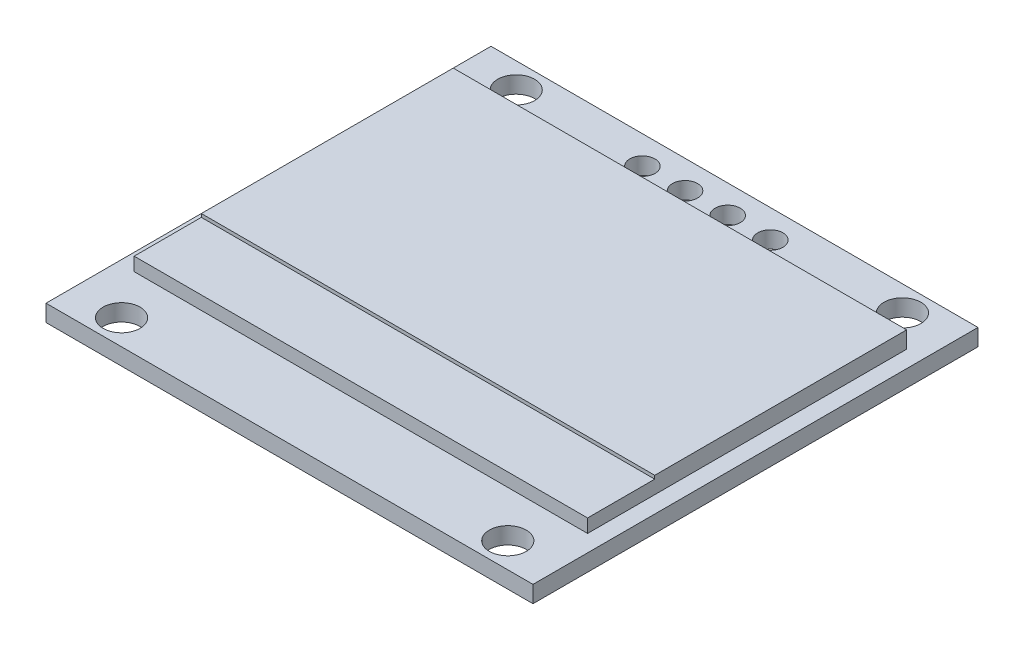
ISO-10303-21;
HEADER;
FILE_DESCRIPTION(('STEP AP214'),'2;1');
FILE_NAME('part.step','',(''),(''),'','','');
FILE_SCHEMA(('AUTOMOTIVE_DESIGN { 1 0 10303 214 1 1 1 1 }'));
ENDSEC;
DATA;
#1=APPLICATION_CONTEXT('core data for automotive mechanical design processes');
#2=APPLICATION_PROTOCOL_DEFINITION('international standard','automotive_design',2000,#1);
#3=PRODUCT_CONTEXT('',#1,'mechanical');
#4=PRODUCT('Part','Part','',(#3));
#5=PRODUCT_RELATED_PRODUCT_CATEGORY('part','',(#4));
#6=PRODUCT_DEFINITION_FORMATION('','',#4);
#7=PRODUCT_DEFINITION_CONTEXT('part definition',#1,'design');
#8=PRODUCT_DEFINITION('design','',#6,#7);
#9=PRODUCT_DEFINITION_SHAPE('','',#8);
#10=(LENGTH_UNIT() NAMED_UNIT(*) SI_UNIT(.MILLI.,.METRE.));
#11=(NAMED_UNIT(*) PLANE_ANGLE_UNIT() SI_UNIT($,.RADIAN.));
#12=(NAMED_UNIT(*) SI_UNIT($,.STERADIAN.) SOLID_ANGLE_UNIT());
#13=UNCERTAINTY_MEASURE_WITH_UNIT(LENGTH_MEASURE(1.E-05),#10,'distance_accuracy_value','');
#14=(GEOMETRIC_REPRESENTATION_CONTEXT(3) GLOBAL_UNCERTAINTY_ASSIGNED_CONTEXT((#13)) GLOBAL_UNIT_ASSIGNED_CONTEXT((#10,
#11,#12)) REPRESENTATION_CONTEXT('',''));
#15=CARTESIAN_POINT('',(0.,0.,0.));
#16=DIRECTION('',(0.,0.,1.));
#17=DIRECTION('',(1.,0.,0.));
#18=AXIS2_PLACEMENT_3D('',#15,#16,#17);
#19=CARTESIAN_POINT('',(0.,1.,0.));
#20=DIRECTION('',(0.,1.,0.));
#21=DIRECTION('',(0.,0.,1.));
#22=AXIS2_PLACEMENT_3D('',#19,#20,#21);
#23=PLANE('',#22);
#24=CARTESIAN_POINT('',(-3.81,1.,-12.0736482504211));
#25=DIRECTION('',(0.,1.,0.));
#26=DIRECTION('',(0.,0.,1.));
#27=AXIS2_PLACEMENT_3D('',#24,#25,#26);
#28=CIRCLE('',#27,0.75);
#29=CARTESIAN_POINT('',(-3.81,1.,-11.3236482504211));
#30=VERTEX_POINT('',#29);
#31=EDGE_CURVE('E235',#30,#30,#28,.T.);
#32=ORIENTED_EDGE('',*,*,#31,.F.);
#33=EDGE_LOOP('',(#32));
#34=FACE_BOUND('',#33,.T.);
#35=CARTESIAN_POINT('',(3.81,1.,-12.0736482504211));
#36=DIRECTION('',(0.,1.,0.));
#37=DIRECTION('',(0.,0.,1.));
#38=AXIS2_PLACEMENT_3D('',#35,#36,#37);
#39=CIRCLE('',#38,0.750000000000001);
#40=CARTESIAN_POINT('',(3.81,1.,-11.3236482504211));
#41=VERTEX_POINT('',#40);
#42=EDGE_CURVE('E238',#41,#41,#39,.T.);
#43=ORIENTED_EDGE('',*,*,#42,.F.);
#44=EDGE_LOOP('',(#43));
#45=FACE_BOUND('',#44,.T.);
#46=CARTESIAN_POINT('',(1.27,1.,-12.0736482504211));
#47=DIRECTION('',(0.,1.,0.));
#48=DIRECTION('',(0.,0.,1.));
#49=AXIS2_PLACEMENT_3D('',#46,#47,#48);
#50=CIRCLE('',#49,0.75);
#51=CARTESIAN_POINT('',(1.27,1.,-11.3236482504211));
#52=VERTEX_POINT('',#51);
#53=EDGE_CURVE('E234',#52,#52,#50,.T.);
#54=ORIENTED_EDGE('',*,*,#53,.F.);
#55=EDGE_LOOP('',(#54));
#56=FACE_BOUND('',#55,.T.);
#57=CARTESIAN_POINT('',(-1.27,1.,-12.0736482504211));
#58=DIRECTION('',(0.,1.,0.));
#59=DIRECTION('',(0.,0.,1.));
#60=AXIS2_PLACEMENT_3D('',#57,#58,#59);
#61=CIRCLE('',#60,0.75);
#62=CARTESIAN_POINT('',(-1.27,1.,-11.3236482504211));
#63=VERTEX_POINT('',#62);
#64=EDGE_CURVE('E221',#63,#63,#61,.T.);
#65=ORIENTED_EDGE('',*,*,#64,.F.);
#66=EDGE_LOOP('',(#65));
#67=FACE_BOUND('',#66,.T.);
#68=CARTESIAN_POINT('',(11.5,1.,-12.25));
#69=DIRECTION('',(0.,1.,0.));
#70=DIRECTION('',(0.,0.,1.));
#71=AXIS2_PLACEMENT_3D('',#68,#69,#70);
#72=CIRCLE('',#71,1.1);
#73=CARTESIAN_POINT('',(11.5,1.,-11.15));
#74=VERTEX_POINT('',#73);
#75=EDGE_CURVE('E174',#74,#74,#72,.T.);
#76=ORIENTED_EDGE('',*,*,#75,.F.);
#77=EDGE_LOOP('',(#76));
#78=FACE_BOUND('',#77,.T.);
#79=CARTESIAN_POINT('',(-11.5,1.,11.25));
#80=DIRECTION('',(0.,1.,0.));
#81=DIRECTION('',(0.,0.,1.));
#82=AXIS2_PLACEMENT_3D('',#79,#80,#81);
#83=CIRCLE('',#82,1.1);
#84=CARTESIAN_POINT('',(-11.5,1.,12.35));
#85=VERTEX_POINT('',#84);
#86=EDGE_CURVE('E181',#85,#85,#83,.T.);
#87=ORIENTED_EDGE('',*,*,#86,.F.);
#88=EDGE_LOOP('',(#87));
#89=FACE_BOUND('',#88,.T.);
#90=CARTESIAN_POINT('',(11.5,1.,11.2499999999999));
#91=DIRECTION('',(0.,1.,0.));
#92=DIRECTION('',(0.,0.,1.));
#93=AXIS2_PLACEMENT_3D('',#90,#91,#92);
#94=CIRCLE('',#93,1.1);
#95=CARTESIAN_POINT('',(11.5,1.,12.3499999999999));
#96=VERTEX_POINT('',#95);
#97=EDGE_CURVE('E168',#96,#96,#94,.T.);
#98=ORIENTED_EDGE('',*,*,#97,.F.);
#99=EDGE_LOOP('',(#98));
#100=FACE_BOUND('',#99,.T.);
#101=CARTESIAN_POINT('',(-11.5,1.,-12.25));
#102=DIRECTION('',(0.,1.,0.));
#103=DIRECTION('',(0.,0.,1.));
#104=AXIS2_PLACEMENT_3D('',#101,#102,#103);
#105=CIRCLE('',#104,1.1);
#106=CARTESIAN_POINT('',(-11.5,1.,-11.15));
#107=VERTEX_POINT('',#106);
#108=EDGE_CURVE('E177',#107,#107,#105,.T.);
#109=ORIENTED_EDGE('',*,*,#108,.F.);
#110=EDGE_LOOP('',(#109));
#111=FACE_BOUND('',#110,.T.);
#112=DIRECTION('',(0.,0.,1.));
#113=VECTOR('',#112,1.);
#114=CARTESIAN_POINT('',(-14.5,1.,-13.75));
#115=LINE('',#114,#113);
#116=CARTESIAN_POINT('',(-14.5,1.,-13.75));
#117=VERTEX_POINT('',#116);
#118=CARTESIAN_POINT('',(-14.5,1.,12.75));
#119=VERTEX_POINT('',#118);
#120=EDGE_CURVE('E192',#117,#119,#115,.T.);
#121=ORIENTED_EDGE('',*,*,#120,.T.);
#122=DIRECTION('',(1.,0.,0.));
#123=VECTOR('',#122,1.);
#124=CARTESIAN_POINT('',(-14.5,1.,12.75));
#125=LINE('',#124,#123);
#126=CARTESIAN_POINT('',(14.5,1.,12.75));
#127=VERTEX_POINT('',#126);
#128=EDGE_CURVE('E195',#119,#127,#125,.T.);
#129=ORIENTED_EDGE('',*,*,#128,.T.);
#130=DIRECTION('',(0.,0.,-1.));
#131=VECTOR('',#130,1.);
#132=CARTESIAN_POINT('',(14.5,1.,-13.75));
#133=LINE('',#132,#131);
#134=CARTESIAN_POINT('',(14.5,1.,-13.75));
#135=VERTEX_POINT('',#134);
#136=EDGE_CURVE('E198',#127,#135,#133,.T.);
#137=ORIENTED_EDGE('',*,*,#136,.T.);
#138=DIRECTION('',(-1.,0.,0.));
#139=VECTOR('',#138,1.);
#140=CARTESIAN_POINT('',(-14.5,1.,-13.75));
#141=LINE('',#140,#139);
#142=EDGE_CURVE('E200',#135,#117,#141,.T.);
#143=ORIENTED_EDGE('',*,*,#142,.T.);
#144=EDGE_LOOP('',(#121,#129,#137,#143));
#145=FACE_BOUND('',#144,.T.);
#146=DIRECTION('',(1.,0.,0.));
#147=VECTOR('',#146,1.);
#148=CARTESIAN_POINT('',(-13.5,1.,8.5));
#149=LINE('',#148,#147);
#150=CARTESIAN_POINT('',(-13.5,1.,8.5));
#151=VERTEX_POINT('',#150);
#152=CARTESIAN_POINT('',(13.5,1.,8.5));
#153=VERTEX_POINT('',#152);
#154=EDGE_CURVE('E126',#151,#153,#149,.T.);
#155=ORIENTED_EDGE('',*,*,#154,.F.);
#156=DIRECTION('',(0.,0.,1.));
#157=VECTOR('',#156,1.);
#158=CARTESIAN_POINT('',(-13.5,1.,-10.5));
#159=LINE('',#158,#157);
#160=CARTESIAN_POINT('',(-13.5,1.,-10.5));
#161=VERTEX_POINT('',#160);
#162=EDGE_CURVE('E139',#161,#151,#159,.T.);
#163=ORIENTED_EDGE('',*,*,#162,.F.);
#164=DIRECTION('',(-1.,0.,0.));
#165=VECTOR('',#164,1.);
#166=CARTESIAN_POINT('',(-13.5,1.,-10.5));
#167=LINE('',#166,#165);
#168=CARTESIAN_POINT('',(13.5,1.,-10.5));
#169=VERTEX_POINT('',#168);
#170=EDGE_CURVE('E149',#169,#161,#167,.T.);
#171=ORIENTED_EDGE('',*,*,#170,.F.);
#172=DIRECTION('',(0.,0.,-1.));
#173=VECTOR('',#172,1.);
#174=CARTESIAN_POINT('',(13.5,1.,-10.5));
#175=LINE('',#174,#173);
#176=EDGE_CURVE('E157',#153,#169,#175,.T.);
#177=ORIENTED_EDGE('',*,*,#176,.F.);
#178=EDGE_LOOP('',(#155,#163,#171,#177));
#179=FACE_BOUND('',#178,.T.);
#180=ADVANCED_FACE('F37',(#34,#45,#56,#67,#78,#89,#100,#111,#145,#179),#23,.T.);
#181=CARTESIAN_POINT('',(-14.5,1.,-13.75));
#182=DIRECTION('',(1.,0.,0.));
#183=DIRECTION('',(0.,0.,-1.));
#184=AXIS2_PLACEMENT_3D('',#181,#182,#183);
#185=PLANE('',#184);
#186=DIRECTION('',(0.,0.,1.));
#187=VECTOR('',#186,1.);
#188=CARTESIAN_POINT('',(-14.5,0.,-13.75));
#189=LINE('',#188,#187);
#190=CARTESIAN_POINT('',(-14.5,0.,-13.75));
#191=VERTEX_POINT('',#190);
#192=CARTESIAN_POINT('',(-14.5,0.,12.75));
#193=VERTEX_POINT('',#192);
#194=EDGE_CURVE('E189',#191,#193,#189,.T.);
#195=ORIENTED_EDGE('',*,*,#194,.T.);
#196=DIRECTION('',(0.,-1.,0.));
#197=VECTOR('',#196,1.);
#198=CARTESIAN_POINT('',(-14.5,1.,12.75));
#199=LINE('',#198,#197);
#200=EDGE_CURVE('E11',#119,#193,#199,.T.);
#201=ORIENTED_EDGE('',*,*,#200,.F.);
#202=ORIENTED_EDGE('',*,*,#120,.F.);
#203=DIRECTION('',(0.,-1.,0.));
#204=VECTOR('',#203,1.);
#205=CARTESIAN_POINT('',(-14.5,1.,-13.75));
#206=LINE('',#205,#204);
#207=EDGE_CURVE('E202',#117,#191,#206,.T.);
#208=ORIENTED_EDGE('',*,*,#207,.T.);
#209=EDGE_LOOP('',(#195,#201,#202,#208));
#210=FACE_BOUND('',#209,.T.);
#211=ADVANCED_FACE('F39',(#210),#185,.F.);
#212=CARTESIAN_POINT('',(-14.5,1.,12.75));
#213=DIRECTION('',(0.,0.,-1.));
#214=DIRECTION('',(-1.,0.,0.));
#215=AXIS2_PLACEMENT_3D('',#212,#213,#214);
#216=PLANE('',#215);
#217=DIRECTION('',(1.,0.,0.));
#218=VECTOR('',#217,1.);
#219=CARTESIAN_POINT('',(-14.5,0.,12.75));
#220=LINE('',#219,#218);
#221=CARTESIAN_POINT('',(14.5,0.,12.75));
#222=VERTEX_POINT('',#221);
#223=EDGE_CURVE('E205',#193,#222,#220,.T.);
#224=ORIENTED_EDGE('',*,*,#223,.T.);
#225=DIRECTION('',(0.,-1.,0.));
#226=VECTOR('',#225,1.);
#227=CARTESIAN_POINT('',(14.5,1.,12.75));
#228=LINE('',#227,#226);
#229=EDGE_CURVE('E46',#127,#222,#228,.T.);
#230=ORIENTED_EDGE('',*,*,#229,.F.);
#231=ORIENTED_EDGE('',*,*,#128,.F.);
#232=ORIENTED_EDGE('',*,*,#200,.T.);
#233=EDGE_LOOP('',(#224,#230,#231,#232));
#234=FACE_BOUND('',#233,.T.);
#235=ADVANCED_FACE('F315',(#234),#216,.F.);
#236=CARTESIAN_POINT('',(14.5,1.,-13.75));
#237=DIRECTION('',(-1.,0.,0.));
#238=DIRECTION('',(0.,0.,1.));
#239=AXIS2_PLACEMENT_3D('',#236,#237,#238);
#240=PLANE('',#239);
#241=DIRECTION('',(0.,0.,-1.));
#242=VECTOR('',#241,1.);
#243=CARTESIAN_POINT('',(14.5,0.,-13.75));
#244=LINE('',#243,#242);
#245=CARTESIAN_POINT('',(14.5,0.,-13.75));
#246=VERTEX_POINT('',#245);
#247=EDGE_CURVE('E207',#222,#246,#244,.T.);
#248=ORIENTED_EDGE('',*,*,#247,.T.);
#249=DIRECTION('',(0.,-1.,0.));
#250=VECTOR('',#249,1.);
#251=CARTESIAN_POINT('',(14.5,1.,-13.75));
#252=LINE('',#251,#250);
#253=EDGE_CURVE('E212',#135,#246,#252,.T.);
#254=ORIENTED_EDGE('',*,*,#253,.F.);
#255=ORIENTED_EDGE('',*,*,#136,.F.);
#256=ORIENTED_EDGE('',*,*,#229,.T.);
#257=EDGE_LOOP('',(#248,#254,#255,#256));
#258=FACE_BOUND('',#257,.T.);
#259=ADVANCED_FACE('F312',(#258),#240,.F.);
#260=CARTESIAN_POINT('',(-14.5,1.,-13.75));
#261=DIRECTION('',(0.,0.,1.));
#262=DIRECTION('',(1.,0.,0.));
#263=AXIS2_PLACEMENT_3D('',#260,#261,#262);
#264=PLANE('',#263);
#265=DIRECTION('',(-1.,0.,0.));
#266=VECTOR('',#265,1.);
#267=CARTESIAN_POINT('',(-14.5,0.,-13.75));
#268=LINE('',#267,#266);
#269=EDGE_CURVE('E196',#246,#191,#268,.T.);
#270=ORIENTED_EDGE('',*,*,#269,.T.);
#271=ORIENTED_EDGE('',*,*,#207,.F.);
#272=ORIENTED_EDGE('',*,*,#142,.F.);
#273=ORIENTED_EDGE('',*,*,#253,.T.);
#274=EDGE_LOOP('',(#270,#271,#272,#273));
#275=FACE_BOUND('',#274,.T.);
#276=ADVANCED_FACE('F309',(#275),#264,.F.);
#277=CARTESIAN_POINT('',(0.,0.,0.));
#278=DIRECTION('',(0.,1.,0.));
#279=DIRECTION('',(0.,0.,1.));
#280=AXIS2_PLACEMENT_3D('',#277,#278,#279);
#281=PLANE('',#280);
#282=CARTESIAN_POINT('',(-3.81,0.,-12.0736482504211));
#283=DIRECTION('',(0.,1.,0.));
#284=DIRECTION('',(0.,0.,1.));
#285=AXIS2_PLACEMENT_3D('',#282,#283,#284);
#286=CIRCLE('',#285,0.75);
#287=CARTESIAN_POINT('',(-3.81,0.,-11.3236482504211));
#288=VERTEX_POINT('',#287);
#289=EDGE_CURVE('E41',#288,#288,#286,.T.);
#290=ORIENTED_EDGE('',*,*,#289,.T.);
#291=EDGE_LOOP('',(#290));
#292=FACE_BOUND('',#291,.T.);
#293=CARTESIAN_POINT('',(3.81,0.,-12.0736482504211));
#294=DIRECTION('',(0.,1.,0.));
#295=DIRECTION('',(0.,0.,1.));
#296=AXIS2_PLACEMENT_3D('',#293,#294,#295);
#297=CIRCLE('',#296,0.750000000000001);
#298=CARTESIAN_POINT('',(3.81,0.,-11.3236482504211));
#299=VERTEX_POINT('',#298);
#300=EDGE_CURVE('E223',#299,#299,#297,.T.);
#301=ORIENTED_EDGE('',*,*,#300,.T.);
#302=EDGE_LOOP('',(#301));
#303=FACE_BOUND('',#302,.T.);
#304=CARTESIAN_POINT('',(1.27,0.,-12.0736482504211));
#305=DIRECTION('',(0.,1.,0.));
#306=DIRECTION('',(0.,0.,1.));
#307=AXIS2_PLACEMENT_3D('',#304,#305,#306);
#308=CIRCLE('',#307,0.75);
#309=CARTESIAN_POINT('',(1.27,0.,-11.3236482504211));
#310=VERTEX_POINT('',#309);
#311=EDGE_CURVE('E220',#310,#310,#308,.T.);
#312=ORIENTED_EDGE('',*,*,#311,.T.);
#313=EDGE_LOOP('',(#312));
#314=FACE_BOUND('',#313,.T.);
#315=CARTESIAN_POINT('',(-1.27,0.,-12.0736482504211));
#316=DIRECTION('',(0.,1.,0.));
#317=DIRECTION('',(0.,0.,1.));
#318=AXIS2_PLACEMENT_3D('',#315,#316,#317);
#319=CIRCLE('',#318,0.75);
#320=CARTESIAN_POINT('',(-1.27,0.,-11.3236482504211));
#321=VERTEX_POINT('',#320);
#322=EDGE_CURVE('E217',#321,#321,#319,.T.);
#323=ORIENTED_EDGE('',*,*,#322,.T.);
#324=EDGE_LOOP('',(#323));
#325=FACE_BOUND('',#324,.T.);
#326=CARTESIAN_POINT('',(11.5,0.,-12.25));
#327=DIRECTION('',(0.,1.,0.));
#328=DIRECTION('',(0.,0.,1.));
#329=AXIS2_PLACEMENT_3D('',#326,#327,#328);
#330=CIRCLE('',#329,1.1);
#331=CARTESIAN_POINT('',(11.5,0.,-11.15));
#332=VERTEX_POINT('',#331);
#333=EDGE_CURVE('E178',#332,#332,#330,.T.);
#334=ORIENTED_EDGE('',*,*,#333,.T.);
#335=EDGE_LOOP('',(#334));
#336=FACE_BOUND('',#335,.T.);
#337=CARTESIAN_POINT('',(-11.5,0.,11.25));
#338=DIRECTION('',(0.,1.,0.));
#339=DIRECTION('',(0.,0.,1.));
#340=AXIS2_PLACEMENT_3D('',#337,#338,#339);
#341=CIRCLE('',#340,1.1);
#342=CARTESIAN_POINT('',(-11.5,0.,12.35));
#343=VERTEX_POINT('',#342);
#344=EDGE_CURVE('E171',#343,#343,#341,.T.);
#345=ORIENTED_EDGE('',*,*,#344,.T.);
#346=EDGE_LOOP('',(#345));
#347=FACE_BOUND('',#346,.T.);
#348=CARTESIAN_POINT('',(11.5,0.,11.2499999999999));
#349=DIRECTION('',(0.,1.,0.));
#350=DIRECTION('',(0.,0.,1.));
#351=AXIS2_PLACEMENT_3D('',#348,#349,#350);
#352=CIRCLE('',#351,1.1);
#353=CARTESIAN_POINT('',(11.5,0.,12.3499999999999));
#354=VERTEX_POINT('',#353);
#355=EDGE_CURVE('E167',#354,#354,#352,.T.);
#356=ORIENTED_EDGE('',*,*,#355,.T.);
#357=EDGE_LOOP('',(#356));
#358=FACE_BOUND('',#357,.T.);
#359=CARTESIAN_POINT('',(-11.5,0.,-12.25));
#360=DIRECTION('',(0.,1.,0.));
#361=DIRECTION('',(0.,0.,1.));
#362=AXIS2_PLACEMENT_3D('',#359,#360,#361);
#363=CIRCLE('',#362,1.1);
#364=CARTESIAN_POINT('',(-11.5,0.,-11.15));
#365=VERTEX_POINT('',#364);
#366=EDGE_CURVE('E186',#365,#365,#363,.T.);
#367=ORIENTED_EDGE('',*,*,#366,.T.);
#368=EDGE_LOOP('',(#367));
#369=FACE_BOUND('',#368,.T.);
#370=ORIENTED_EDGE('',*,*,#194,.F.);
#371=ORIENTED_EDGE('',*,*,#269,.F.);
#372=ORIENTED_EDGE('',*,*,#247,.F.);
#373=ORIENTED_EDGE('',*,*,#223,.F.);
#374=EDGE_LOOP('',(#370,#371,#372,#373));
#375=FACE_BOUND('',#374,.T.);
#376=ADVANCED_FACE('F304',(#292,#303,#314,#325,#336,#347,#358,#369,#375),#281,.F.);
#377=CARTESIAN_POINT('',(-11.5,0.,-12.25));
#378=DIRECTION('',(0.,1.,0.));
#379=DIRECTION('',(0.,0.,1.));
#380=AXIS2_PLACEMENT_3D('',#377,#378,#379);
#381=CYLINDRICAL_SURFACE('',#380,1.1);
#382=ORIENTED_EDGE('',*,*,#366,.F.);
#383=EDGE_LOOP('',(#382));
#384=FACE_BOUND('',#383,.T.);
#385=ORIENTED_EDGE('',*,*,#108,.T.);
#386=EDGE_LOOP('',(#385));
#387=FACE_BOUND('',#386,.T.);
#388=ADVANCED_FACE('F295',(#384,#387),#381,.F.);
#389=CARTESIAN_POINT('',(11.5,0.,11.2499999999999));
#390=DIRECTION('',(0.,1.,0.));
#391=DIRECTION('',(0.,0.,1.));
#392=AXIS2_PLACEMENT_3D('',#389,#390,#391);
#393=CYLINDRICAL_SURFACE('',#392,1.1);
#394=ORIENTED_EDGE('',*,*,#355,.F.);
#395=EDGE_LOOP('',(#394));
#396=FACE_BOUND('',#395,.T.);
#397=ORIENTED_EDGE('',*,*,#97,.T.);
#398=EDGE_LOOP('',(#397));
#399=FACE_BOUND('',#398,.T.);
#400=ADVANCED_FACE('F291',(#396,#399),#393,.F.);
#401=CARTESIAN_POINT('',(-11.5,0.,11.25));
#402=DIRECTION('',(0.,1.,0.));
#403=DIRECTION('',(0.,0.,1.));
#404=AXIS2_PLACEMENT_3D('',#401,#402,#403);
#405=CYLINDRICAL_SURFACE('',#404,1.1);
#406=ORIENTED_EDGE('',*,*,#344,.F.);
#407=EDGE_LOOP('',(#406));
#408=FACE_BOUND('',#407,.T.);
#409=ORIENTED_EDGE('',*,*,#86,.T.);
#410=EDGE_LOOP('',(#409));
#411=FACE_BOUND('',#410,.T.);
#412=ADVANCED_FACE('F294',(#408,#411),#405,.F.);
#413=CARTESIAN_POINT('',(11.5,0.,-12.25));
#414=DIRECTION('',(0.,1.,0.));
#415=DIRECTION('',(0.,0.,1.));
#416=AXIS2_PLACEMENT_3D('',#413,#414,#415);
#417=CYLINDRICAL_SURFACE('',#416,1.1);
#418=ORIENTED_EDGE('',*,*,#333,.F.);
#419=EDGE_LOOP('',(#418));
#420=FACE_BOUND('',#419,.T.);
#421=ORIENTED_EDGE('',*,*,#75,.T.);
#422=EDGE_LOOP('',(#421));
#423=FACE_BOUND('',#422,.T.);
#424=ADVANCED_FACE('F290',(#420,#423),#417,.F.);
#425=CARTESIAN_POINT('',(-13.5,2.,-10.5));
#426=DIRECTION('',(1.,0.,0.));
#427=DIRECTION('',(0.,0.,-1.));
#428=AXIS2_PLACEMENT_3D('',#425,#426,#427);
#429=PLANE('',#428);
#430=DIRECTION('',(0.,-1.,0.));
#431=VECTOR('',#430,1.);
#432=CARTESIAN_POINT('',(-13.5,2.,-10.5));
#433=LINE('',#432,#431);
#434=CARTESIAN_POINT('',(-13.5,2.,-10.5));
#435=VERTEX_POINT('',#434);
#436=EDGE_CURVE('E155',#435,#161,#433,.T.);
#437=ORIENTED_EDGE('',*,*,#436,.T.);
#438=ORIENTED_EDGE('',*,*,#162,.T.);
#439=DIRECTION('',(0.,-1.,0.));
#440=VECTOR('',#439,1.);
#441=CARTESIAN_POINT('',(-13.5,1.8,8.5));
#442=LINE('',#441,#440);
#443=CARTESIAN_POINT('',(-13.5,1.8,8.5));
#444=VERTEX_POINT('',#443);
#445=EDGE_CURVE('E132',#444,#151,#442,.T.);
#446=ORIENTED_EDGE('',*,*,#445,.F.);
#447=DIRECTION('',(0.,0.,1.));
#448=VECTOR('',#447,1.);
#449=CARTESIAN_POINT('',(-13.5,1.8,-10.5));
#450=LINE('',#449,#448);
#451=CARTESIAN_POINT('',(-13.5,1.8,4.5));
#452=VERTEX_POINT('',#451);
#453=EDGE_CURVE('E116',#452,#444,#450,.T.);
#454=ORIENTED_EDGE('',*,*,#453,.F.);
#455=DIRECTION('',(0.,-1.,0.));
#456=VECTOR('',#455,1.);
#457=CARTESIAN_POINT('',(-13.5,2.,4.5));
#458=LINE('',#457,#456);
#459=CARTESIAN_POINT('',(-13.5,2.,4.5));
#460=VERTEX_POINT('',#459);
#461=EDGE_CURVE('E165',#460,#452,#458,.T.);
#462=ORIENTED_EDGE('',*,*,#461,.F.);
#463=DIRECTION('',(0.,0.,1.));
#464=VECTOR('',#463,1.);
#465=CARTESIAN_POINT('',(-13.5,2.,-10.5));
#466=LINE('',#465,#464);
#467=EDGE_CURVE('E145',#435,#460,#466,.T.);
#468=ORIENTED_EDGE('',*,*,#467,.F.);
#469=EDGE_LOOP('',(#437,#438,#446,#454,#462,#468));
#470=FACE_BOUND('',#469,.T.);
#471=ADVANCED_FACE('F137',(#470),#429,.F.);
#472=CARTESIAN_POINT('',(-13.5,2.,4.5));
#473=DIRECTION('',(0.,0.,-1.));
#474=DIRECTION('',(-1.,0.,0.));
#475=AXIS2_PLACEMENT_3D('',#472,#473,#474);
#476=PLANE('',#475);
#477=ORIENTED_EDGE('',*,*,#461,.T.);
#478=DIRECTION('',(1.,0.,0.));
#479=VECTOR('',#478,1.);
#480=CARTESIAN_POINT('',(-13.5,1.8,4.5));
#481=LINE('',#480,#479);
#482=CARTESIAN_POINT('',(13.5,1.8,4.5));
#483=VERTEX_POINT('',#482);
#484=EDGE_CURVE('E121',#452,#483,#481,.T.);
#485=ORIENTED_EDGE('',*,*,#484,.T.);
#486=DIRECTION('',(0.,-1.,0.));
#487=VECTOR('',#486,1.);
#488=CARTESIAN_POINT('',(13.5,2.,4.5));
#489=LINE('',#488,#487);
#490=CARTESIAN_POINT('',(13.5,2.,4.5));
#491=VERTEX_POINT('',#490);
#492=EDGE_CURVE('E162',#491,#483,#489,.T.);
#493=ORIENTED_EDGE('',*,*,#492,.F.);
#494=DIRECTION('',(1.,0.,0.));
#495=VECTOR('',#494,1.);
#496=CARTESIAN_POINT('',(-13.5,2.,4.5));
#497=LINE('',#496,#495);
#498=EDGE_CURVE('E148',#460,#491,#497,.T.);
#499=ORIENTED_EDGE('',*,*,#498,.F.);
#500=EDGE_LOOP('',(#477,#485,#493,#499));
#501=FACE_BOUND('',#500,.T.);
#502=ADVANCED_FACE('F270',(#501),#476,.F.);
#503=CARTESIAN_POINT('',(13.5,2.,-10.5));
#504=DIRECTION('',(-1.,0.,0.));
#505=DIRECTION('',(0.,0.,1.));
#506=AXIS2_PLACEMENT_3D('',#503,#504,#505);
#507=PLANE('',#506);
#508=ORIENTED_EDGE('',*,*,#492,.T.);
#509=DIRECTION('',(0.,0.,-1.));
#510=VECTOR('',#509,1.);
#511=CARTESIAN_POINT('',(13.5,1.8,-10.5));
#512=LINE('',#511,#510);
#513=CARTESIAN_POINT('',(13.5,1.8,8.5));
#514=VERTEX_POINT('',#513);
#515=EDGE_CURVE('E54',#514,#483,#512,.T.);
#516=ORIENTED_EDGE('',*,*,#515,.F.);
#517=DIRECTION('',(0.,-1.,0.));
#518=VECTOR('',#517,1.);
#519=CARTESIAN_POINT('',(13.5,1.8,8.5));
#520=LINE('',#519,#518);
#521=EDGE_CURVE('E135',#514,#153,#520,.T.);
#522=ORIENTED_EDGE('',*,*,#521,.T.);
#523=ORIENTED_EDGE('',*,*,#176,.T.);
#524=DIRECTION('',(0.,-1.,0.));
#525=VECTOR('',#524,1.);
#526=CARTESIAN_POINT('',(13.5,2.,-10.5));
#527=LINE('',#526,#525);
#528=CARTESIAN_POINT('',(13.5,2.,-10.5));
#529=VERTEX_POINT('',#528);
#530=EDGE_CURVE('E62',#529,#169,#527,.T.);
#531=ORIENTED_EDGE('',*,*,#530,.F.);
#532=DIRECTION('',(0.,0.,-1.));
#533=VECTOR('',#532,1.);
#534=CARTESIAN_POINT('',(13.5,2.,-10.5));
#535=LINE('',#534,#533);
#536=EDGE_CURVE('E151',#491,#529,#535,.T.);
#537=ORIENTED_EDGE('',*,*,#536,.F.);
#538=EDGE_LOOP('',(#508,#516,#522,#523,#531,#537));
#539=FACE_BOUND('',#538,.T.);
#540=ADVANCED_FACE('F266',(#539),#507,.F.);
#541=CARTESIAN_POINT('',(-13.5,2.,-10.5));
#542=DIRECTION('',(0.,0.,1.));
#543=DIRECTION('',(1.,0.,0.));
#544=AXIS2_PLACEMENT_3D('',#541,#542,#543);
#545=PLANE('',#544);
#546=ORIENTED_EDGE('',*,*,#530,.T.);
#547=ORIENTED_EDGE('',*,*,#170,.T.);
#548=ORIENTED_EDGE('',*,*,#436,.F.);
#549=DIRECTION('',(-1.,0.,0.));
#550=VECTOR('',#549,1.);
#551=CARTESIAN_POINT('',(-13.5,2.,-10.5));
#552=LINE('',#551,#550);
#553=EDGE_CURVE('E153',#529,#435,#552,.T.);
#554=ORIENTED_EDGE('',*,*,#553,.F.);
#555=EDGE_LOOP('',(#546,#547,#548,#554));
#556=FACE_BOUND('',#555,.T.);
#557=ADVANCED_FACE('F275',(#556),#545,.F.);
#558=CARTESIAN_POINT('',(0.,2.,0.));
#559=DIRECTION('',(0.,1.,0.));
#560=DIRECTION('',(0.,0.,1.));
#561=AXIS2_PLACEMENT_3D('',#558,#559,#560);
#562=PLANE('',#561);
#563=ORIENTED_EDGE('',*,*,#467,.T.);
#564=ORIENTED_EDGE('',*,*,#498,.T.);
#565=ORIENTED_EDGE('',*,*,#536,.T.);
#566=ORIENTED_EDGE('',*,*,#553,.T.);
#567=EDGE_LOOP('',(#563,#564,#565,#566));
#568=FACE_BOUND('',#567,.T.);
#569=ADVANCED_FACE('F274',(#568),#562,.T.);
#570=CARTESIAN_POINT('',(0.,1.8,0.));
#571=DIRECTION('',(0.,1.,0.));
#572=DIRECTION('',(0.,0.,1.));
#573=AXIS2_PLACEMENT_3D('',#570,#571,#572);
#574=PLANE('',#573);
#575=ORIENTED_EDGE('',*,*,#484,.F.);
#576=ORIENTED_EDGE('',*,*,#453,.T.);
#577=DIRECTION('',(1.,0.,0.));
#578=VECTOR('',#577,1.);
#579=CARTESIAN_POINT('',(-13.5,1.8,8.5));
#580=LINE('',#579,#578);
#581=EDGE_CURVE('E119',#444,#514,#580,.T.);
#582=ORIENTED_EDGE('',*,*,#581,.T.);
#583=ORIENTED_EDGE('',*,*,#515,.T.);
#584=EDGE_LOOP('',(#575,#576,#582,#583));
#585=FACE_BOUND('',#584,.T.);
#586=ADVANCED_FACE('F118',(#585),#574,.T.);
#587=CARTESIAN_POINT('',(-13.5,1.8,8.5));
#588=DIRECTION('',(0.,0.,-1.));
#589=DIRECTION('',(-1.,0.,0.));
#590=AXIS2_PLACEMENT_3D('',#587,#588,#589);
#591=PLANE('',#590);
#592=ORIENTED_EDGE('',*,*,#154,.T.);
#593=ORIENTED_EDGE('',*,*,#521,.F.);
#594=ORIENTED_EDGE('',*,*,#581,.F.);
#595=ORIENTED_EDGE('',*,*,#445,.T.);
#596=EDGE_LOOP('',(#592,#593,#594,#595));
#597=FACE_BOUND('',#596,.T.);
#598=ADVANCED_FACE('F131',(#597),#591,.F.);
#599=CARTESIAN_POINT('',(-1.27,-9.8,-12.0736482504211));
#600=DIRECTION('',(0.,1.,0.));
#601=DIRECTION('',(0.,0.,1.));
#602=AXIS2_PLACEMENT_3D('',#599,#600,#601);
#603=CYLINDRICAL_SURFACE('',#602,0.75);
#604=ORIENTED_EDGE('',*,*,#64,.T.);
#605=EDGE_LOOP('',(#604));
#606=FACE_BOUND('',#605,.T.);
#607=ORIENTED_EDGE('',*,*,#322,.F.);
#608=EDGE_LOOP('',(#607));
#609=FACE_BOUND('',#608,.T.);
#610=ADVANCED_FACE('F360',(#606,#609),#603,.F.);
#611=CARTESIAN_POINT('',(1.27,-9.8,-12.0736482504211));
#612=DIRECTION('',(0.,1.,0.));
#613=DIRECTION('',(0.,0.,1.));
#614=AXIS2_PLACEMENT_3D('',#611,#612,#613);
#615=CYLINDRICAL_SURFACE('',#614,0.75);
#616=ORIENTED_EDGE('',*,*,#53,.T.);
#617=EDGE_LOOP('',(#616));
#618=FACE_BOUND('',#617,.T.);
#619=ORIENTED_EDGE('',*,*,#311,.F.);
#620=EDGE_LOOP('',(#619));
#621=FACE_BOUND('',#620,.T.);
#622=ADVANCED_FACE('F244',(#618,#621),#615,.F.);
#623=CARTESIAN_POINT('',(3.81,-9.8,-12.0736482504211));
#624=DIRECTION('',(0.,1.,0.));
#625=DIRECTION('',(0.,0.,1.));
#626=AXIS2_PLACEMENT_3D('',#623,#624,#625);
#627=CYLINDRICAL_SURFACE('',#626,0.750000000000001);
#628=ORIENTED_EDGE('',*,*,#42,.T.);
#629=EDGE_LOOP('',(#628));
#630=FACE_BOUND('',#629,.T.);
#631=ORIENTED_EDGE('',*,*,#300,.F.);
#632=EDGE_LOOP('',(#631));
#633=FACE_BOUND('',#632,.T.);
#634=ADVANCED_FACE('F375',(#630,#633),#627,.F.);
#635=CARTESIAN_POINT('',(-3.81,-9.8,-12.0736482504211));
#636=DIRECTION('',(0.,1.,0.));
#637=DIRECTION('',(0.,0.,1.));
#638=AXIS2_PLACEMENT_3D('',#635,#636,#637);
#639=CYLINDRICAL_SURFACE('',#638,0.75);
#640=ORIENTED_EDGE('',*,*,#31,.T.);
#641=EDGE_LOOP('',(#640));
#642=FACE_BOUND('',#641,.T.);
#643=ORIENTED_EDGE('',*,*,#289,.F.);
#644=EDGE_LOOP('',(#643));
#645=FACE_BOUND('',#644,.T.);
#646=ADVANCED_FACE('F385',(#642,#645),#639,.F.);
#647=CLOSED_SHELL('',(#180,#211,#235,#259,#276,#376,#388,#400,#412,#424,#471,#502,#540,#557,
#569,#586,#598,#610,#622,#634,#646));
#648=MANIFOLD_SOLID_BREP('B2',#647);
#649=ADVANCED_BREP_SHAPE_REPRESENTATION('',(#18,#648),#14);
#650=SHAPE_DEFINITION_REPRESENTATION(#9,#649);
ENDSEC;
END-ISO-10303-21;
